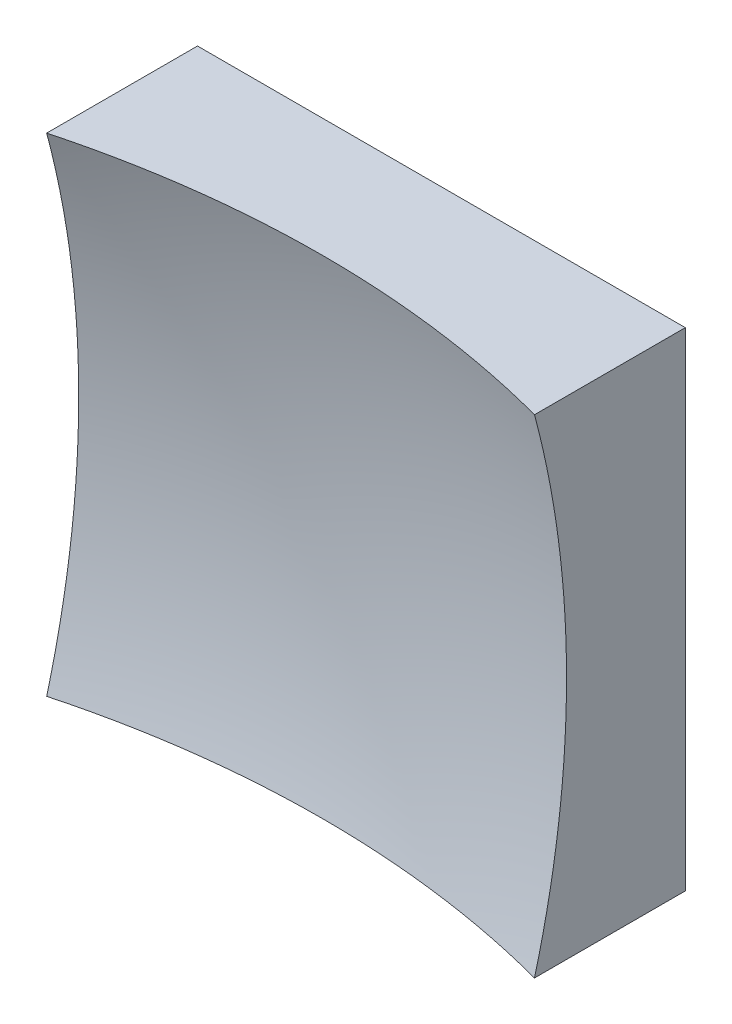
ISO-10303-21;
HEADER;
FILE_DESCRIPTION(('STEP AP214'),'2;1');
FILE_NAME('part.step','',(''),(''),'','','');
FILE_SCHEMA(('AUTOMOTIVE_DESIGN { 1 0 10303 214 1 1 1 1 }'));
ENDSEC;
DATA;
#1=APPLICATION_CONTEXT('core data for automotive mechanical design processes');
#2=APPLICATION_PROTOCOL_DEFINITION('international standard','automotive_design',2000,#1);
#3=PRODUCT_CONTEXT('',#1,'mechanical');
#4=PRODUCT('Part','Part','',(#3));
#5=PRODUCT_RELATED_PRODUCT_CATEGORY('part','',(#4));
#6=PRODUCT_DEFINITION_FORMATION('','',#4);
#7=PRODUCT_DEFINITION_CONTEXT('part definition',#1,'design');
#8=PRODUCT_DEFINITION('design','',#6,#7);
#9=PRODUCT_DEFINITION_SHAPE('','',#8);
#10=(LENGTH_UNIT() NAMED_UNIT(*) SI_UNIT(.MILLI.,.METRE.));
#11=(NAMED_UNIT(*) PLANE_ANGLE_UNIT() SI_UNIT($,.RADIAN.));
#12=(NAMED_UNIT(*) SI_UNIT($,.STERADIAN.) SOLID_ANGLE_UNIT());
#13=UNCERTAINTY_MEASURE_WITH_UNIT(LENGTH_MEASURE(1.E-05),#10,'distance_accuracy_value','');
#14=(GEOMETRIC_REPRESENTATION_CONTEXT(3) GLOBAL_UNCERTAINTY_ASSIGNED_CONTEXT((#13)) GLOBAL_UNIT_ASSIGNED_CONTEXT((#10,
#11,#12)) REPRESENTATION_CONTEXT('',''));
#15=CARTESIAN_POINT('',(0.,0.,0.));
#16=DIRECTION('',(0.,0.,1.));
#17=DIRECTION('',(1.,0.,0.));
#18=AXIS2_PLACEMENT_3D('',#15,#16,#17);
#19=CARTESIAN_POINT('',(-25.,25.,50.));
#20=DIRECTION('',(0.,1.,0.));
#21=DIRECTION('',(0.,0.,1.));
#22=AXIS2_PLACEMENT_3D('',#19,#20,#21);
#23=PLANE('',#22);
#24=CARTESIAN_POINT('',(0.,25.,109.));
#25=DIRECTION('',(0.,1.,0.));
#26=DIRECTION('',(0.,0.,1.));
#27=AXIS2_PLACEMENT_3D('',#24,#25,#26);
#28=CIRCLE('',#27,96.8245836551854);
#29=CARTESIAN_POINT('',(25.,25.,15.4585653306515));
#30=VERTEX_POINT('',#29);
#31=CARTESIAN_POINT('',(-25.,25.,15.4585653306515));
#32=VERTEX_POINT('',#31);
#33=EDGE_CURVE('E79',#30,#32,#28,.T.);
#34=ORIENTED_EDGE('',*,*,#33,.F.);
#35=DIRECTION('',(0.,0.,-1.));
#36=VECTOR('',#35,1.);
#37=CARTESIAN_POINT('',(25.,25.,50.));
#38=LINE('',#37,#36);
#39=CARTESIAN_POINT('',(25.,25.,0.));
#40=VERTEX_POINT('',#39);
#41=EDGE_CURVE('E85',#30,#40,#38,.T.);
#42=ORIENTED_EDGE('',*,*,#41,.T.);
#43=DIRECTION('',(1.,0.,0.));
#44=VECTOR('',#43,1.);
#45=CARTESIAN_POINT('',(-25.,25.,0.));
#46=LINE('',#45,#44);
#47=CARTESIAN_POINT('',(-25.,25.,0.));
#48=VERTEX_POINT('',#47);
#49=EDGE_CURVE('E88',#48,#40,#46,.T.);
#50=ORIENTED_EDGE('',*,*,#49,.F.);
#51=DIRECTION('',(0.,0.,-1.));
#52=VECTOR('',#51,1.);
#53=CARTESIAN_POINT('',(-25.,25.,50.));
#54=LINE('',#53,#52);
#55=EDGE_CURVE('E47',#32,#48,#54,.T.);
#56=ORIENTED_EDGE('',*,*,#55,.F.);
#57=EDGE_LOOP('',(#34,#42,#50,#56));
#58=FACE_BOUND('',#57,.T.);
#59=ADVANCED_FACE('F39',(#58),#23,.T.);
#60=CARTESIAN_POINT('',(-25.,25.,50.));
#61=DIRECTION('',(1.,0.,0.));
#62=DIRECTION('',(0.,1.,0.));
#63=AXIS2_PLACEMENT_3D('',#60,#61,#62);
#64=PLANE('',#63);
#65=DIRECTION('',(0.,0.,-1.));
#66=VECTOR('',#65,1.);
#67=CARTESIAN_POINT('',(-25.,-25.,50.));
#68=LINE('',#67,#66);
#69=CARTESIAN_POINT('',(-25.,-25.,15.4585653306515));
#70=VERTEX_POINT('',#69);
#71=CARTESIAN_POINT('',(-25.,-25.,0.));
#72=VERTEX_POINT('',#71);
#73=EDGE_CURVE('E100',#70,#72,#68,.T.);
#74=ORIENTED_EDGE('',*,*,#73,.F.);
#75=CARTESIAN_POINT('',(-25.,0.,109.));
#76=DIRECTION('',(1.,0.,0.));
#77=DIRECTION('',(0.,1.,0.));
#78=AXIS2_PLACEMENT_3D('',#75,#76,#77);
#79=CIRCLE('',#78,96.8245836551854);
#80=EDGE_CURVE('E89',#70,#32,#79,.T.);
#81=ORIENTED_EDGE('',*,*,#80,.T.);
#82=ORIENTED_EDGE('',*,*,#55,.T.);
#83=DIRECTION('',(0.,-1.,0.));
#84=VECTOR('',#83,1.);
#85=CARTESIAN_POINT('',(-25.,25.,0.));
#86=LINE('',#85,#84);
#87=EDGE_CURVE('E97',#48,#72,#86,.T.);
#88=ORIENTED_EDGE('',*,*,#87,.T.);
#89=EDGE_LOOP('',(#74,#81,#82,#88));
#90=FACE_BOUND('',#89,.T.);
#91=ADVANCED_FACE('F122',(#90),#64,.F.);
#92=CARTESIAN_POINT('',(-25.,-25.,50.));
#93=DIRECTION('',(0.,1.,0.));
#94=DIRECTION('',(0.,0.,1.));
#95=AXIS2_PLACEMENT_3D('',#92,#93,#94);
#96=PLANE('',#95);
#97=DIRECTION('',(0.,0.,-1.));
#98=VECTOR('',#97,1.);
#99=CARTESIAN_POINT('',(25.,-25.,50.));
#100=LINE('',#99,#98);
#101=CARTESIAN_POINT('',(25.,-25.,15.4585653306515));
#102=VERTEX_POINT('',#101);
#103=CARTESIAN_POINT('',(25.,-25.,0.));
#104=VERTEX_POINT('',#103);
#105=EDGE_CURVE('E96',#102,#104,#100,.T.);
#106=ORIENTED_EDGE('',*,*,#105,.F.);
#107=CARTESIAN_POINT('',(0.,-25.,109.));
#108=DIRECTION('',(0.,1.,0.));
#109=DIRECTION('',(0.,0.,1.));
#110=AXIS2_PLACEMENT_3D('',#107,#108,#109);
#111=CIRCLE('',#110,96.8245836551854);
#112=EDGE_CURVE('E53',#102,#70,#111,.T.);
#113=ORIENTED_EDGE('',*,*,#112,.T.);
#114=ORIENTED_EDGE('',*,*,#73,.T.);
#115=DIRECTION('',(1.,0.,0.));
#116=VECTOR('',#115,1.);
#117=CARTESIAN_POINT('',(-25.,-25.,0.));
#118=LINE('',#117,#116);
#119=EDGE_CURVE('E102',#72,#104,#118,.T.);
#120=ORIENTED_EDGE('',*,*,#119,.T.);
#121=EDGE_LOOP('',(#106,#113,#114,#120));
#122=FACE_BOUND('',#121,.T.);
#123=ADVANCED_FACE('F121',(#122),#96,.F.);
#124=CARTESIAN_POINT('',(25.,25.,50.));
#125=DIRECTION('',(1.,0.,0.));
#126=DIRECTION('',(0.,1.,0.));
#127=AXIS2_PLACEMENT_3D('',#124,#125,#126);
#128=PLANE('',#127);
#129=CARTESIAN_POINT('',(25.,0.,109.));
#130=DIRECTION('',(1.,0.,0.));
#131=DIRECTION('',(0.,1.,0.));
#132=AXIS2_PLACEMENT_3D('',#129,#130,#131);
#133=CIRCLE('',#132,96.8245836551854);
#134=EDGE_CURVE('E11',#102,#30,#133,.T.);
#135=ORIENTED_EDGE('',*,*,#134,.F.);
#136=ORIENTED_EDGE('',*,*,#105,.T.);
#137=DIRECTION('',(0.,-1.,0.));
#138=VECTOR('',#137,1.);
#139=CARTESIAN_POINT('',(25.,25.,0.));
#140=LINE('',#139,#138);
#141=EDGE_CURVE('E93',#40,#104,#140,.T.);
#142=ORIENTED_EDGE('',*,*,#141,.F.);
#143=ORIENTED_EDGE('',*,*,#41,.F.);
#144=EDGE_LOOP('',(#135,#136,#142,#143));
#145=FACE_BOUND('',#144,.T.);
#146=ADVANCED_FACE('F91',(#145),#128,.T.);
#147=CARTESIAN_POINT('',(0.,0.,0.));
#148=DIRECTION('',(0.,0.,-1.));
#149=DIRECTION('',(-1.,0.,0.));
#150=AXIS2_PLACEMENT_3D('',#147,#148,#149);
#151=PLANE('',#150);
#152=ORIENTED_EDGE('',*,*,#49,.T.);
#153=ORIENTED_EDGE('',*,*,#141,.T.);
#154=ORIENTED_EDGE('',*,*,#119,.F.);
#155=ORIENTED_EDGE('',*,*,#87,.F.);
#156=EDGE_LOOP('',(#152,#153,#154,#155));
#157=FACE_BOUND('',#156,.T.);
#158=ADVANCED_FACE('F125',(#157),#151,.T.);
#159=CARTESIAN_POINT('',(0.,0.,109.));
#160=DIRECTION('',(0.,0.,1.));
#161=DIRECTION('',(1.,0.,0.));
#162=AXIS2_PLACEMENT_3D('',#159,#160,#161);
#163=SPHERICAL_SURFACE('',#162,99.9999999999999);
#164=ORIENTED_EDGE('',*,*,#33,.T.);
#165=ORIENTED_EDGE('',*,*,#80,.F.);
#166=ORIENTED_EDGE('',*,*,#112,.F.);
#167=ORIENTED_EDGE('',*,*,#134,.T.);
#168=EDGE_LOOP('',(#164,#165,#166,#167));
#169=FACE_BOUND('',#168,.T.);
#170=ADVANCED_FACE('F78',(#169),#163,.F.);
#171=CLOSED_SHELL('',(#59,#91,#123,#146,#158,#170));
#172=MANIFOLD_SOLID_BREP('B2',#171);
#173=ADVANCED_BREP_SHAPE_REPRESENTATION('',(#18,#172),#14);
#174=SHAPE_DEFINITION_REPRESENTATION(#9,#173);
ENDSEC;
END-ISO-10303-21;
